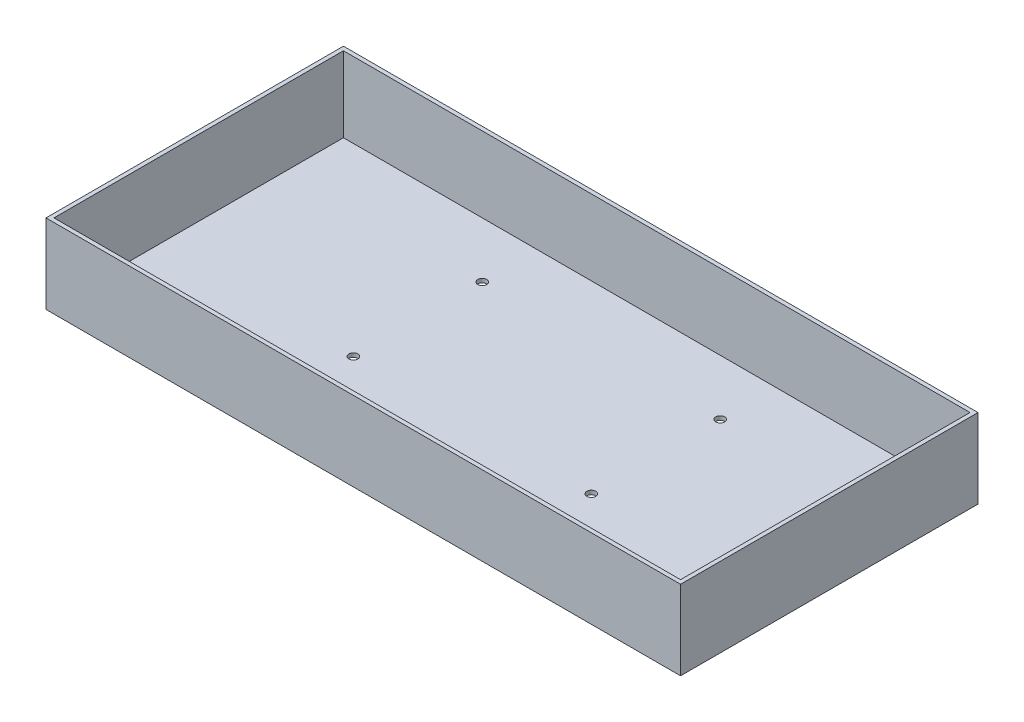
ISO-10303-21;
HEADER;
FILE_DESCRIPTION(('STEP AP214'),'2;1');
FILE_NAME('part.step','',(''),(''),'','','');
FILE_SCHEMA(('AUTOMOTIVE_DESIGN { 1 0 10303 214 1 1 1 1 }'));
ENDSEC;
DATA;
#1=APPLICATION_CONTEXT('core data for automotive mechanical design processes');
#2=APPLICATION_PROTOCOL_DEFINITION('international standard','automotive_design',2000,#1);
#3=PRODUCT_CONTEXT('',#1,'mechanical');
#4=PRODUCT('Part','Part','',(#3));
#5=PRODUCT_RELATED_PRODUCT_CATEGORY('part','',(#4));
#6=PRODUCT_DEFINITION_FORMATION('','',#4);
#7=PRODUCT_DEFINITION_CONTEXT('part definition',#1,'design');
#8=PRODUCT_DEFINITION('design','',#6,#7);
#9=PRODUCT_DEFINITION_SHAPE('','',#8);
#10=(LENGTH_UNIT() NAMED_UNIT(*) SI_UNIT(.MILLI.,.METRE.));
#11=(NAMED_UNIT(*) PLANE_ANGLE_UNIT() SI_UNIT($,.RADIAN.));
#12=(NAMED_UNIT(*) SI_UNIT($,.STERADIAN.) SOLID_ANGLE_UNIT());
#13=UNCERTAINTY_MEASURE_WITH_UNIT(LENGTH_MEASURE(1.E-05),#10,'distance_accuracy_value','');
#14=(GEOMETRIC_REPRESENTATION_CONTEXT(3) GLOBAL_UNCERTAINTY_ASSIGNED_CONTEXT((#13)) GLOBAL_UNIT_ASSIGNED_CONTEXT((#10,
#11,#12)) REPRESENTATION_CONTEXT('',''));
#15=CARTESIAN_POINT('',(0.,0.,0.));
#16=DIRECTION('',(0.,0.,1.));
#17=DIRECTION('',(1.,0.,0.));
#18=AXIS2_PLACEMENT_3D('',#15,#16,#17);
#19=CARTESIAN_POINT('',(0.,40.,0.));
#20=DIRECTION('',(0.,-1.,0.));
#21=DIRECTION('',(0.,0.,-1.));
#22=AXIS2_PLACEMENT_3D('',#19,#20,#21);
#23=PLANE('',#22);
#24=DIRECTION('',(0.,0.,1.));
#25=VECTOR('',#24,1.);
#26=CARTESIAN_POINT('',(0.,40.,0.));
#27=LINE('',#26,#25);
#28=CARTESIAN_POINT('',(0.,40.,-150.));
#29=VERTEX_POINT('',#28);
#30=CARTESIAN_POINT('',(0.,40.,0.));
#31=VERTEX_POINT('',#30);
#32=EDGE_CURVE('E143',#29,#31,#27,.T.);
#33=ORIENTED_EDGE('',*,*,#32,.T.);
#34=DIRECTION('',(1.,0.,0.));
#35=VECTOR('',#34,1.);
#36=CARTESIAN_POINT('',(0.,40.,0.));
#37=LINE('',#36,#35);
#38=CARTESIAN_POINT('',(320.,40.,0.));
#39=VERTEX_POINT('',#38);
#40=EDGE_CURVE('E87',#31,#39,#37,.T.);
#41=ORIENTED_EDGE('',*,*,#40,.T.);
#42=DIRECTION('',(0.,0.,-1.));
#43=VECTOR('',#42,1.);
#44=CARTESIAN_POINT('',(320.,40.,0.));
#45=LINE('',#44,#43);
#46=CARTESIAN_POINT('',(320.,40.,-150.));
#47=VERTEX_POINT('',#46);
#48=EDGE_CURVE('E146',#39,#47,#45,.T.);
#49=ORIENTED_EDGE('',*,*,#48,.T.);
#50=DIRECTION('',(-1.,0.,0.));
#51=VECTOR('',#50,1.);
#52=CARTESIAN_POINT('',(0.,40.,-150.));
#53=LINE('',#52,#51);
#54=EDGE_CURVE('E59',#47,#29,#53,.T.);
#55=ORIENTED_EDGE('',*,*,#54,.T.);
#56=EDGE_LOOP('',(#33,#41,#49,#55));
#57=FACE_BOUND('',#56,.T.);
#58=DIRECTION('',(0.,0.,1.));
#59=VECTOR('',#58,1.);
#60=CARTESIAN_POINT('',(2.,40.,0.));
#61=LINE('',#60,#59);
#62=CARTESIAN_POINT('',(2.,40.,-148.));
#63=VERTEX_POINT('',#62);
#64=CARTESIAN_POINT('',(2.,40.,-2.));
#65=VERTEX_POINT('',#64);
#66=EDGE_CURVE('E132',#63,#65,#61,.T.);
#67=ORIENTED_EDGE('',*,*,#66,.F.);
#68=DIRECTION('',(-1.,0.,0.));
#69=VECTOR('',#68,1.);
#70=CARTESIAN_POINT('',(0.,40.,-148.));
#71=LINE('',#70,#69);
#72=CARTESIAN_POINT('',(318.,40.,-148.));
#73=VERTEX_POINT('',#72);
#74=EDGE_CURVE('E141',#73,#63,#71,.T.);
#75=ORIENTED_EDGE('',*,*,#74,.F.);
#76=DIRECTION('',(0.,0.,-1.));
#77=VECTOR('',#76,1.);
#78=CARTESIAN_POINT('',(318.,40.,0.));
#79=LINE('',#78,#77);
#80=CARTESIAN_POINT('',(318.,40.,-2.));
#81=VERTEX_POINT('',#80);
#82=EDGE_CURVE('E139',#81,#73,#79,.T.);
#83=ORIENTED_EDGE('',*,*,#82,.F.);
#84=DIRECTION('',(1.,0.,0.));
#85=VECTOR('',#84,1.);
#86=CARTESIAN_POINT('',(0.,40.,-2.));
#87=LINE('',#86,#85);
#88=EDGE_CURVE('E124',#65,#81,#87,.T.);
#89=ORIENTED_EDGE('',*,*,#88,.F.);
#90=EDGE_LOOP('',(#67,#75,#83,#89));
#91=FACE_BOUND('',#90,.T.);
#92=ADVANCED_FACE('F35',(#57,#91),#23,.F.);
#93=CARTESIAN_POINT('',(0.,40.,0.));
#94=DIRECTION('',(1.,0.,0.));
#95=DIRECTION('',(0.,0.,-1.));
#96=AXIS2_PLACEMENT_3D('',#93,#94,#95);
#97=PLANE('',#96);
#98=DIRECTION('',(0.,0.,1.));
#99=VECTOR('',#98,1.);
#100=CARTESIAN_POINT('',(0.,0.,0.));
#101=LINE('',#100,#99);
#102=CARTESIAN_POINT('',(0.,0.,-150.));
#103=VERTEX_POINT('',#102);
#104=CARTESIAN_POINT('',(0.,0.,0.));
#105=VERTEX_POINT('',#104);
#106=EDGE_CURVE('E150',#103,#105,#101,.T.);
#107=ORIENTED_EDGE('',*,*,#106,.T.);
#108=DIRECTION('',(0.,-1.,0.));
#109=VECTOR('',#108,1.);
#110=CARTESIAN_POINT('',(0.,40.,0.));
#111=LINE('',#110,#109);
#112=EDGE_CURVE('E11',#31,#105,#111,.T.);
#113=ORIENTED_EDGE('',*,*,#112,.F.);
#114=ORIENTED_EDGE('',*,*,#32,.F.);
#115=DIRECTION('',(0.,-1.,0.));
#116=VECTOR('',#115,1.);
#117=CARTESIAN_POINT('',(0.,40.,-150.));
#118=LINE('',#117,#116);
#119=EDGE_CURVE('E149',#29,#103,#118,.T.);
#120=ORIENTED_EDGE('',*,*,#119,.T.);
#121=EDGE_LOOP('',(#107,#113,#114,#120));
#122=FACE_BOUND('',#121,.T.);
#123=ADVANCED_FACE('F37',(#122),#97,.F.);
#124=CARTESIAN_POINT('',(0.,40.,0.));
#125=DIRECTION('',(0.,0.,-1.));
#126=DIRECTION('',(-1.,0.,0.));
#127=AXIS2_PLACEMENT_3D('',#124,#125,#126);
#128=PLANE('',#127);
#129=DIRECTION('',(1.,0.,0.));
#130=VECTOR('',#129,1.);
#131=CARTESIAN_POINT('',(0.,0.,0.));
#132=LINE('',#131,#130);
#133=CARTESIAN_POINT('',(320.,0.,0.));
#134=VERTEX_POINT('',#133);
#135=EDGE_CURVE('E153',#105,#134,#132,.T.);
#136=ORIENTED_EDGE('',*,*,#135,.T.);
#137=DIRECTION('',(0.,-1.,0.));
#138=VECTOR('',#137,1.);
#139=CARTESIAN_POINT('',(320.,40.,0.));
#140=LINE('',#139,#138);
#141=EDGE_CURVE('E43',#39,#134,#140,.T.);
#142=ORIENTED_EDGE('',*,*,#141,.F.);
#143=ORIENTED_EDGE('',*,*,#40,.F.);
#144=ORIENTED_EDGE('',*,*,#112,.T.);
#145=EDGE_LOOP('',(#136,#142,#143,#144));
#146=FACE_BOUND('',#145,.T.);
#147=ADVANCED_FACE('F183',(#146),#128,.F.);
#148=CARTESIAN_POINT('',(320.,40.,0.));
#149=DIRECTION('',(-1.,0.,0.));
#150=DIRECTION('',(0.,0.,1.));
#151=AXIS2_PLACEMENT_3D('',#148,#149,#150);
#152=PLANE('',#151);
#153=DIRECTION('',(0.,0.,-1.));
#154=VECTOR('',#153,1.);
#155=CARTESIAN_POINT('',(320.,0.,0.));
#156=LINE('',#155,#154);
#157=CARTESIAN_POINT('',(320.,0.,-150.));
#158=VERTEX_POINT('',#157);
#159=EDGE_CURVE('E155',#134,#158,#156,.T.);
#160=ORIENTED_EDGE('',*,*,#159,.T.);
#161=DIRECTION('',(0.,-1.,0.));
#162=VECTOR('',#161,1.);
#163=CARTESIAN_POINT('',(320.,40.,-150.));
#164=LINE('',#163,#162);
#165=EDGE_CURVE('E159',#47,#158,#164,.T.);
#166=ORIENTED_EDGE('',*,*,#165,.F.);
#167=ORIENTED_EDGE('',*,*,#48,.F.);
#168=ORIENTED_EDGE('',*,*,#141,.T.);
#169=EDGE_LOOP('',(#160,#166,#167,#168));
#170=FACE_BOUND('',#169,.T.);
#171=ADVANCED_FACE('F164',(#170),#152,.F.);
#172=CARTESIAN_POINT('',(0.,40.,-150.));
#173=DIRECTION('',(0.,0.,1.));
#174=DIRECTION('',(1.,0.,0.));
#175=AXIS2_PLACEMENT_3D('',#172,#173,#174);
#176=PLANE('',#175);
#177=DIRECTION('',(-1.,0.,0.));
#178=VECTOR('',#177,1.);
#179=CARTESIAN_POINT('',(0.,0.,-150.));
#180=LINE('',#179,#178);
#181=EDGE_CURVE('E80',#158,#103,#180,.T.);
#182=ORIENTED_EDGE('',*,*,#181,.T.);
#183=ORIENTED_EDGE('',*,*,#119,.F.);
#184=ORIENTED_EDGE('',*,*,#54,.F.);
#185=ORIENTED_EDGE('',*,*,#165,.T.);
#186=EDGE_LOOP('',(#182,#183,#184,#185));
#187=FACE_BOUND('',#186,.T.);
#188=ADVANCED_FACE('F172',(#187),#176,.F.);
#189=CARTESIAN_POINT('',(0.,0.,0.));
#190=DIRECTION('',(0.,-1.,0.));
#191=DIRECTION('',(0.,0.,-1.));
#192=AXIS2_PLACEMENT_3D('',#189,#190,#191);
#193=PLANE('',#192);
#194=CARTESIAN_POINT('',(100.,0.,-120.));
#195=DIRECTION('',(0.,-1.,0.));
#196=DIRECTION('',(0.,0.,-1.));
#197=AXIS2_PLACEMENT_3D('',#194,#195,#196);
#198=CIRCLE('',#197,2.25);
#199=CARTESIAN_POINT('',(100.,0.,-122.25));
#200=VERTEX_POINT('',#199);
#201=EDGE_CURVE('E243',#200,#200,#198,.T.);
#202=ORIENTED_EDGE('',*,*,#201,.F.);
#203=EDGE_LOOP('',(#202));
#204=FACE_BOUND('',#203,.T.);
#205=CARTESIAN_POINT('',(220.,0.,-120.));
#206=DIRECTION('',(0.,-1.,0.));
#207=DIRECTION('',(0.,0.,-1.));
#208=AXIS2_PLACEMENT_3D('',#205,#206,#207);
#209=CIRCLE('',#208,2.25000000000001);
#210=CARTESIAN_POINT('',(220.,0.,-122.25));
#211=VERTEX_POINT('',#210);
#212=EDGE_CURVE('E235',#211,#211,#209,.T.);
#213=ORIENTED_EDGE('',*,*,#212,.F.);
#214=EDGE_LOOP('',(#213));
#215=FACE_BOUND('',#214,.T.);
#216=CARTESIAN_POINT('',(220.,0.,-55.));
#217=DIRECTION('',(0.,-1.,0.));
#218=DIRECTION('',(0.,0.,-1.));
#219=AXIS2_PLACEMENT_3D('',#216,#217,#218);
#220=CIRCLE('',#219,2.25000000000001);
#221=CARTESIAN_POINT('',(220.,0.,-57.25));
#222=VERTEX_POINT('',#221);
#223=EDGE_CURVE('E228',#222,#222,#220,.T.);
#224=ORIENTED_EDGE('',*,*,#223,.F.);
#225=EDGE_LOOP('',(#224));
#226=FACE_BOUND('',#225,.T.);
#227=CARTESIAN_POINT('',(100.,0.,-55.));
#228=DIRECTION('',(0.,-1.,0.));
#229=DIRECTION('',(0.,0.,-1.));
#230=AXIS2_PLACEMENT_3D('',#227,#228,#229);
#231=CIRCLE('',#230,2.25);
#232=CARTESIAN_POINT('',(100.,0.,-57.25));
#233=VERTEX_POINT('',#232);
#234=EDGE_CURVE('E232',#233,#233,#231,.T.);
#235=ORIENTED_EDGE('',*,*,#234,.F.);
#236=EDGE_LOOP('',(#235));
#237=FACE_BOUND('',#236,.T.);
#238=ORIENTED_EDGE('',*,*,#106,.F.);
#239=ORIENTED_EDGE('',*,*,#181,.F.);
#240=ORIENTED_EDGE('',*,*,#159,.F.);
#241=ORIENTED_EDGE('',*,*,#135,.F.);
#242=EDGE_LOOP('',(#238,#239,#240,#241));
#243=FACE_BOUND('',#242,.T.);
#244=ADVANCED_FACE('F168',(#204,#215,#226,#237,#243),#193,.T.);
#245=CARTESIAN_POINT('',(2.,40.,0.));
#246=DIRECTION('',(1.,0.,0.));
#247=DIRECTION('',(0.,0.,-1.));
#248=AXIS2_PLACEMENT_3D('',#245,#246,#247);
#249=PLANE('',#248);
#250=DIRECTION('',(0.,0.,1.));
#251=VECTOR('',#250,1.);
#252=CARTESIAN_POINT('',(2.,2.,0.));
#253=LINE('',#252,#251);
#254=CARTESIAN_POINT('',(2.,2.,-148.));
#255=VERTEX_POINT('',#254);
#256=CARTESIAN_POINT('',(2.,2.,-2.));
#257=VERTEX_POINT('',#256);
#258=EDGE_CURVE('E115',#255,#257,#253,.T.);
#259=ORIENTED_EDGE('',*,*,#258,.F.);
#260=DIRECTION('',(0.,-1.,0.));
#261=VECTOR('',#260,1.);
#262=CARTESIAN_POINT('',(2.,40.,-148.));
#263=LINE('',#262,#261);
#264=EDGE_CURVE('E135',#63,#255,#263,.T.);
#265=ORIENTED_EDGE('',*,*,#264,.F.);
#266=ORIENTED_EDGE('',*,*,#66,.T.);
#267=DIRECTION('',(0.,-1.,0.));
#268=VECTOR('',#267,1.);
#269=CARTESIAN_POINT('',(2.,40.,-2.));
#270=LINE('',#269,#268);
#271=EDGE_CURVE('E127',#65,#257,#270,.T.);
#272=ORIENTED_EDGE('',*,*,#271,.T.);
#273=EDGE_LOOP('',(#259,#265,#266,#272));
#274=FACE_BOUND('',#273,.T.);
#275=ADVANCED_FACE('F180',(#274),#249,.T.);
#276=CARTESIAN_POINT('',(0.,40.,-2.));
#277=DIRECTION('',(0.,0.,-1.));
#278=DIRECTION('',(-1.,0.,0.));
#279=AXIS2_PLACEMENT_3D('',#276,#277,#278);
#280=PLANE('',#279);
#281=DIRECTION('',(1.,0.,0.));
#282=VECTOR('',#281,1.);
#283=CARTESIAN_POINT('',(0.,2.,-2.));
#284=LINE('',#283,#282);
#285=CARTESIAN_POINT('',(318.,2.,-2.));
#286=VERTEX_POINT('',#285);
#287=EDGE_CURVE('E109',#257,#286,#284,.T.);
#288=ORIENTED_EDGE('',*,*,#287,.F.);
#289=ORIENTED_EDGE('',*,*,#271,.F.);
#290=ORIENTED_EDGE('',*,*,#88,.T.);
#291=DIRECTION('',(0.,-1.,0.));
#292=VECTOR('',#291,1.);
#293=CARTESIAN_POINT('',(318.,40.,-2.));
#294=LINE('',#293,#292);
#295=EDGE_CURVE('E121',#81,#286,#294,.T.);
#296=ORIENTED_EDGE('',*,*,#295,.T.);
#297=EDGE_LOOP('',(#288,#289,#290,#296));
#298=FACE_BOUND('',#297,.T.);
#299=ADVANCED_FACE('F122',(#298),#280,.T.);
#300=CARTESIAN_POINT('',(318.,40.,0.));
#301=DIRECTION('',(-1.,0.,0.));
#302=DIRECTION('',(0.,0.,1.));
#303=AXIS2_PLACEMENT_3D('',#300,#301,#302);
#304=PLANE('',#303);
#305=DIRECTION('',(0.,0.,-1.));
#306=VECTOR('',#305,1.);
#307=CARTESIAN_POINT('',(318.,2.,0.));
#308=LINE('',#307,#306);
#309=CARTESIAN_POINT('',(318.,2.,-148.));
#310=VERTEX_POINT('',#309);
#311=EDGE_CURVE('E113',#286,#310,#308,.T.);
#312=ORIENTED_EDGE('',*,*,#311,.F.);
#313=ORIENTED_EDGE('',*,*,#295,.F.);
#314=ORIENTED_EDGE('',*,*,#82,.T.);
#315=DIRECTION('',(0.,-1.,0.));
#316=VECTOR('',#315,1.);
#317=CARTESIAN_POINT('',(318.,40.,-148.));
#318=LINE('',#317,#316);
#319=EDGE_CURVE('E50',#73,#310,#318,.T.);
#320=ORIENTED_EDGE('',*,*,#319,.T.);
#321=EDGE_LOOP('',(#312,#313,#314,#320));
#322=FACE_BOUND('',#321,.T.);
#323=ADVANCED_FACE('F129',(#322),#304,.T.);
#324=CARTESIAN_POINT('',(0.,40.,-148.));
#325=DIRECTION('',(0.,0.,1.));
#326=DIRECTION('',(1.,0.,0.));
#327=AXIS2_PLACEMENT_3D('',#324,#325,#326);
#328=PLANE('',#327);
#329=DIRECTION('',(-1.,0.,0.));
#330=VECTOR('',#329,1.);
#331=CARTESIAN_POINT('',(0.,2.,-148.));
#332=LINE('',#331,#330);
#333=EDGE_CURVE('E130',#310,#255,#332,.T.);
#334=ORIENTED_EDGE('',*,*,#333,.F.);
#335=ORIENTED_EDGE('',*,*,#319,.F.);
#336=ORIENTED_EDGE('',*,*,#74,.T.);
#337=ORIENTED_EDGE('',*,*,#264,.T.);
#338=EDGE_LOOP('',(#334,#335,#336,#337));
#339=FACE_BOUND('',#338,.T.);
#340=ADVANCED_FACE('F195',(#339),#328,.T.);
#341=CARTESIAN_POINT('',(0.,2.,0.));
#342=DIRECTION('',(0.,-1.,0.));
#343=DIRECTION('',(0.,0.,-1.));
#344=AXIS2_PLACEMENT_3D('',#341,#342,#343);
#345=PLANE('',#344);
#346=CARTESIAN_POINT('',(100.,2.,-120.));
#347=DIRECTION('',(0.,-1.,0.));
#348=DIRECTION('',(0.,0.,-1.));
#349=AXIS2_PLACEMENT_3D('',#346,#347,#348);
#350=CIRCLE('',#349,2.25);
#351=CARTESIAN_POINT('',(100.,2.,-122.25));
#352=VERTEX_POINT('',#351);
#353=EDGE_CURVE('E240',#352,#352,#350,.T.);
#354=ORIENTED_EDGE('',*,*,#353,.T.);
#355=EDGE_LOOP('',(#354));
#356=FACE_BOUND('',#355,.T.);
#357=CARTESIAN_POINT('',(220.,2.,-120.));
#358=DIRECTION('',(0.,-1.,0.));
#359=DIRECTION('',(0.,0.,-1.));
#360=AXIS2_PLACEMENT_3D('',#357,#358,#359);
#361=CIRCLE('',#360,2.25000000000001);
#362=CARTESIAN_POINT('',(220.,2.,-122.25));
#363=VERTEX_POINT('',#362);
#364=EDGE_CURVE('E230',#363,#363,#361,.T.);
#365=ORIENTED_EDGE('',*,*,#364,.T.);
#366=EDGE_LOOP('',(#365));
#367=FACE_BOUND('',#366,.T.);
#368=CARTESIAN_POINT('',(220.,2.,-55.));
#369=DIRECTION('',(0.,-1.,0.));
#370=DIRECTION('',(0.,0.,-1.));
#371=AXIS2_PLACEMENT_3D('',#368,#369,#370);
#372=CIRCLE('',#371,2.25000000000001);
#373=CARTESIAN_POINT('',(220.,2.,-57.25));
#374=VERTEX_POINT('',#373);
#375=EDGE_CURVE('E225',#374,#374,#372,.T.);
#376=ORIENTED_EDGE('',*,*,#375,.T.);
#377=EDGE_LOOP('',(#376));
#378=FACE_BOUND('',#377,.T.);
#379=CARTESIAN_POINT('',(100.,2.,-55.));
#380=DIRECTION('',(0.,-1.,0.));
#381=DIRECTION('',(0.,0.,-1.));
#382=AXIS2_PLACEMENT_3D('',#379,#380,#381);
#383=CIRCLE('',#382,2.25);
#384=CARTESIAN_POINT('',(100.,2.,-57.25));
#385=VERTEX_POINT('',#384);
#386=EDGE_CURVE('E246',#385,#385,#383,.T.);
#387=ORIENTED_EDGE('',*,*,#386,.T.);
#388=EDGE_LOOP('',(#387));
#389=FACE_BOUND('',#388,.T.);
#390=ORIENTED_EDGE('',*,*,#258,.T.);
#391=ORIENTED_EDGE('',*,*,#287,.T.);
#392=ORIENTED_EDGE('',*,*,#311,.T.);
#393=ORIENTED_EDGE('',*,*,#333,.T.);
#394=EDGE_LOOP('',(#390,#391,#392,#393));
#395=FACE_BOUND('',#394,.T.);
#396=ADVANCED_FACE('F111',(#356,#367,#378,#389,#395),#345,.F.);
#397=CARTESIAN_POINT('',(100.,2.,-55.));
#398=DIRECTION('',(0.,-1.,0.));
#399=DIRECTION('',(0.,0.,-1.));
#400=AXIS2_PLACEMENT_3D('',#397,#398,#399);
#401=CYLINDRICAL_SURFACE('',#400,2.25);
#402=ORIENTED_EDGE('',*,*,#386,.F.);
#403=EDGE_LOOP('',(#402));
#404=FACE_BOUND('',#403,.T.);
#405=ORIENTED_EDGE('',*,*,#234,.T.);
#406=EDGE_LOOP('',(#405));
#407=FACE_BOUND('',#406,.T.);
#408=ADVANCED_FACE('F194',(#404,#407),#401,.F.);
#409=CARTESIAN_POINT('',(220.,2.,-55.));
#410=DIRECTION('',(0.,-1.,0.));
#411=DIRECTION('',(0.,0.,-1.));
#412=AXIS2_PLACEMENT_3D('',#409,#410,#411);
#413=CYLINDRICAL_SURFACE('',#412,2.25000000000001);
#414=ORIENTED_EDGE('',*,*,#375,.F.);
#415=EDGE_LOOP('',(#414));
#416=FACE_BOUND('',#415,.T.);
#417=ORIENTED_EDGE('',*,*,#223,.T.);
#418=EDGE_LOOP('',(#417));
#419=FACE_BOUND('',#418,.T.);
#420=ADVANCED_FACE('F208',(#416,#419),#413,.F.);
#421=CARTESIAN_POINT('',(220.,2.,-120.));
#422=DIRECTION('',(0.,-1.,0.));
#423=DIRECTION('',(0.,0.,-1.));
#424=AXIS2_PLACEMENT_3D('',#421,#422,#423);
#425=CYLINDRICAL_SURFACE('',#424,2.25000000000001);
#426=ORIENTED_EDGE('',*,*,#364,.F.);
#427=EDGE_LOOP('',(#426));
#428=FACE_BOUND('',#427,.T.);
#429=ORIENTED_EDGE('',*,*,#212,.T.);
#430=EDGE_LOOP('',(#429));
#431=FACE_BOUND('',#430,.T.);
#432=ADVANCED_FACE('F213',(#428,#431),#425,.F.);
#433=CARTESIAN_POINT('',(100.,2.,-120.));
#434=DIRECTION('',(0.,-1.,0.));
#435=DIRECTION('',(0.,0.,-1.));
#436=AXIS2_PLACEMENT_3D('',#433,#434,#435);
#437=CYLINDRICAL_SURFACE('',#436,2.25);
#438=ORIENTED_EDGE('',*,*,#353,.F.);
#439=EDGE_LOOP('',(#438));
#440=FACE_BOUND('',#439,.T.);
#441=ORIENTED_EDGE('',*,*,#201,.T.);
#442=EDGE_LOOP('',(#441));
#443=FACE_BOUND('',#442,.T.);
#444=ADVANCED_FACE('F210',(#440,#443),#437,.F.);
#445=CLOSED_SHELL('',(#92,#123,#147,#171,#188,#244,#275,#299,#323,#340,#396,#408,#420,#432,#444));
#446=MANIFOLD_SOLID_BREP('B2',#445);
#447=ADVANCED_BREP_SHAPE_REPRESENTATION('',(#18,#446),#14);
#448=SHAPE_DEFINITION_REPRESENTATION(#9,#447);
ENDSEC;
END-ISO-10303-21;
